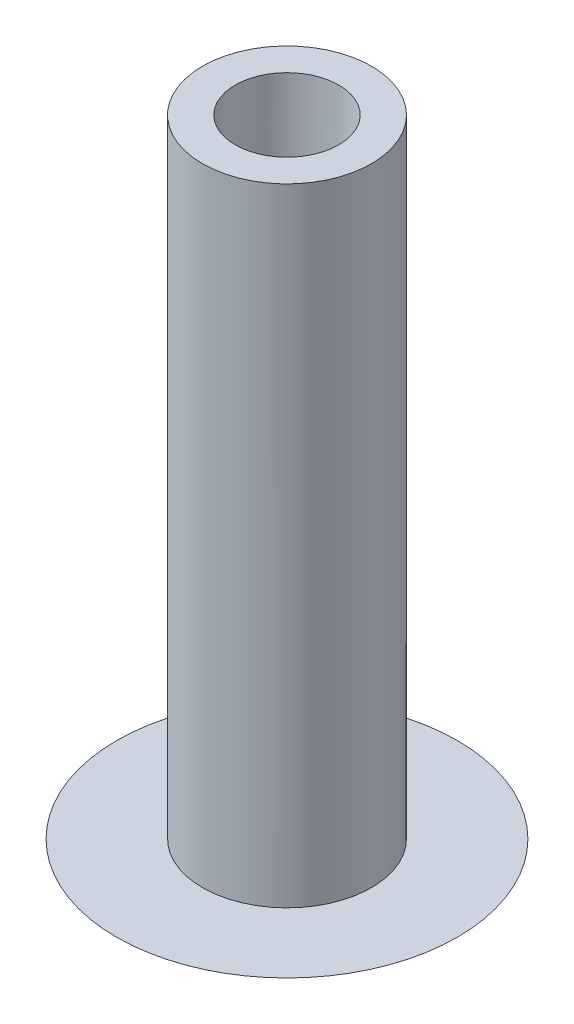
ISO-10303-21;
HEADER;
FILE_DESCRIPTION(('STEP AP214'),'2;1');
FILE_NAME('part.step','',(''),(''),'','','');
FILE_SCHEMA(('AUTOMOTIVE_DESIGN { 1 0 10303 214 1 1 1 1 }'));
ENDSEC;
DATA;
#1=APPLICATION_CONTEXT('core data for automotive mechanical design processes');
#2=APPLICATION_PROTOCOL_DEFINITION('international standard','automotive_design',2000,#1);
#3=PRODUCT_CONTEXT('',#1,'mechanical');
#4=PRODUCT('Part','Part','',(#3));
#5=PRODUCT_RELATED_PRODUCT_CATEGORY('part','',(#4));
#6=PRODUCT_DEFINITION_FORMATION('','',#4);
#7=PRODUCT_DEFINITION_CONTEXT('part definition',#1,'design');
#8=PRODUCT_DEFINITION('design','',#6,#7);
#9=PRODUCT_DEFINITION_SHAPE('','',#8);
#10=(LENGTH_UNIT() NAMED_UNIT(*) SI_UNIT(.MILLI.,.METRE.));
#11=(NAMED_UNIT(*) PLANE_ANGLE_UNIT() SI_UNIT($,.RADIAN.));
#12=(NAMED_UNIT(*) SI_UNIT($,.STERADIAN.) SOLID_ANGLE_UNIT());
#13=UNCERTAINTY_MEASURE_WITH_UNIT(LENGTH_MEASURE(1.E-05),#10,'distance_accuracy_value','');
#14=(GEOMETRIC_REPRESENTATION_CONTEXT(3) GLOBAL_UNCERTAINTY_ASSIGNED_CONTEXT((#13)) GLOBAL_UNIT_ASSIGNED_CONTEXT((#10,
#11,#12)) REPRESENTATION_CONTEXT('',''));
#15=CARTESIAN_POINT('',(0.,0.,0.));
#16=DIRECTION('',(0.,0.,1.));
#17=DIRECTION('',(1.,0.,0.));
#18=AXIS2_PLACEMENT_3D('',#15,#16,#17);
#19=CARTESIAN_POINT('',(0.,29.21,0.));
#20=DIRECTION('',(0.,1.,0.));
#21=DIRECTION('',(0.,0.,1.));
#22=AXIS2_PLACEMENT_3D('',#19,#20,#21);
#23=PLANE('',#22);
#24=CARTESIAN_POINT('',(0.,29.21,0.));
#25=DIRECTION('',(0.,1.,0.));
#26=DIRECTION('',(0.,0.,1.));
#27=AXIS2_PLACEMENT_3D('',#24,#25,#26);
#28=CIRCLE('',#27,3.937);
#29=CARTESIAN_POINT('',(0.,29.21,3.937));
#30=VERTEX_POINT('',#29);
#31=EDGE_CURVE('E45',#30,#30,#28,.T.);
#32=ORIENTED_EDGE('',*,*,#31,.T.);
#33=EDGE_LOOP('',(#32));
#34=FACE_BOUND('',#33,.T.);
#35=CARTESIAN_POINT('',(0.,29.21,0.));
#36=DIRECTION('',(0.,1.,0.));
#37=DIRECTION('',(0.,0.,1.));
#38=AXIS2_PLACEMENT_3D('',#35,#36,#37);
#39=CIRCLE('',#38,2.413);
#40=CARTESIAN_POINT('',(0.,29.21,2.413));
#41=VERTEX_POINT('',#40);
#42=EDGE_CURVE('E50',#41,#41,#39,.T.);
#43=ORIENTED_EDGE('',*,*,#42,.F.);
#44=EDGE_LOOP('',(#43));
#45=FACE_BOUND('',#44,.T.);
#46=ADVANCED_FACE('F37',(#34,#45),#23,.T.);
#47=CARTESIAN_POINT('',(0.,29.21,0.));
#48=DIRECTION('',(0.,-1.,0.));
#49=DIRECTION('',(0.,0.,-1.));
#50=AXIS2_PLACEMENT_3D('',#47,#48,#49);
#51=CYLINDRICAL_SURFACE('',#50,3.937);
#52=ORIENTED_EDGE('',*,*,#31,.F.);
#53=EDGE_LOOP('',(#52));
#54=FACE_BOUND('',#53,.T.);
#55=CARTESIAN_POINT('',(0.,0.,0.));
#56=DIRECTION('',(0.,1.,0.));
#57=DIRECTION('',(-1.,0.,0.));
#58=AXIS2_PLACEMENT_3D('',#55,#56,#57);
#59=CIRCLE('',#58,3.937);
#60=CARTESIAN_POINT('',(-3.937,0.,0.));
#61=VERTEX_POINT('',#60);
#62=EDGE_CURVE('E55',#61,#61,#59,.T.);
#63=ORIENTED_EDGE('',*,*,#62,.T.);
#64=EDGE_LOOP('',(#63));
#65=FACE_BOUND('',#64,.T.);
#66=ADVANCED_FACE('F39',(#54,#65),#51,.T.);
#67=CARTESIAN_POINT('',(0.,11.13234375,0.));
#68=DIRECTION('',(0.,1.,0.));
#69=DIRECTION('',(1.,0.,0.));
#70=AXIS2_PLACEMENT_3D('',#67,#68,#69);
#71=SPHERICAL_SURFACE('',#70,13.67234375);
#72=CARTESIAN_POINT('',(0.,0.,0.));
#73=DIRECTION('',(0.,1.,0.));
#74=DIRECTION('',(-1.,0.,0.));
#75=AXIS2_PLACEMENT_3D('',#72,#73,#74);
#76=CIRCLE('',#75,7.9375);
#77=CARTESIAN_POINT('',(-7.9375,0.,0.));
#78=VERTEX_POINT('',#77);
#79=EDGE_CURVE('E61',#78,#78,#76,.T.);
#80=ORIENTED_EDGE('',*,*,#79,.F.);
#81=EDGE_LOOP('',(#80));
#82=FACE_BOUND('',#81,.T.);
#83=ADVANCED_FACE('F68',(#82),#71,.T.);
#84=CARTESIAN_POINT('',(0.,0.,0.));
#85=DIRECTION('',(0.,1.,0.));
#86=DIRECTION('',(-1.,0.,0.));
#87=AXIS2_PLACEMENT_3D('',#84,#85,#86);
#88=PLANE('',#87);
#89=ORIENTED_EDGE('',*,*,#62,.F.);
#90=EDGE_LOOP('',(#89));
#91=FACE_BOUND('',#90,.T.);
#92=ORIENTED_EDGE('',*,*,#79,.T.);
#93=EDGE_LOOP('',(#92));
#94=FACE_BOUND('',#93,.T.);
#95=ADVANCED_FACE('F66',(#91,#94),#88,.T.);
#96=CARTESIAN_POINT('',(0.,29.21,0.));
#97=DIRECTION('',(0.,1.,0.));
#98=DIRECTION('',(0.,0.,1.));
#99=AXIS2_PLACEMENT_3D('',#96,#97,#98);
#100=CONICAL_SURFACE('',#99,2.413,0.0299910048568779);
#101=CARTESIAN_POINT('',(0.,0.,0.));
#102=DIRECTION('',(0.,1.,0.));
#103=DIRECTION('',(-1.,0.,0.));
#104=AXIS2_PLACEMENT_3D('',#101,#102,#103);
#105=CIRCLE('',#104,1.5367);
#106=CARTESIAN_POINT('',(-1.53669999999999,0.,0.));
#107=VERTEX_POINT('',#106);
#108=EDGE_CURVE('E10',#107,#107,#105,.F.);
#109=ORIENTED_EDGE('',*,*,#108,.T.);
#110=EDGE_LOOP('',(#109));
#111=FACE_BOUND('',#110,.T.);
#112=ORIENTED_EDGE('',*,*,#42,.T.);
#113=EDGE_LOOP('',(#112));
#114=FACE_BOUND('',#113,.T.);
#115=ADVANCED_FACE('F75',(#111,#114),#100,.F.);
#116=ORIENTED_EDGE('',*,*,#108,.F.);
#117=EDGE_LOOP('',(#116));
#118=FACE_BOUND('',#117,.T.);
#119=ADVANCED_FACE('F78',(#118),#88,.T.);
#120=CLOSED_SHELL('',(#46,#66,#83,#95,#115,#119));
#121=MANIFOLD_SOLID_BREP('B2',#120);
#122=ADVANCED_BREP_SHAPE_REPRESENTATION('',(#18,#121),#14);
#123=SHAPE_DEFINITION_REPRESENTATION(#9,#122);
ENDSEC;
END-ISO-10303-21;
